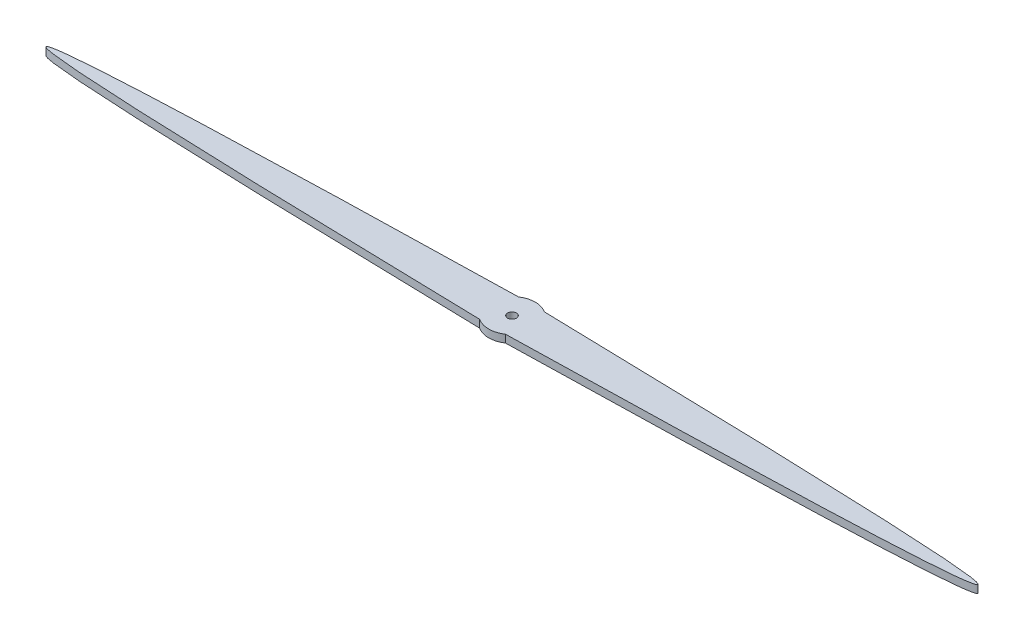
ISO-10303-21;
HEADER;
FILE_DESCRIPTION(('STEP AP214'),'2;1');
FILE_NAME('part.step','',(''),(''),'','','');
FILE_SCHEMA(('AUTOMOTIVE_DESIGN { 1 0 10303 214 1 1 1 1 }'));
ENDSEC;
DATA;
#1=APPLICATION_CONTEXT('core data for automotive mechanical design processes');
#2=APPLICATION_PROTOCOL_DEFINITION('international standard','automotive_design',2000,#1);
#3=PRODUCT_CONTEXT('',#1,'mechanical');
#4=PRODUCT('Part','Part','',(#3));
#5=PRODUCT_RELATED_PRODUCT_CATEGORY('part','',(#4));
#6=PRODUCT_DEFINITION_FORMATION('','',#4);
#7=PRODUCT_DEFINITION_CONTEXT('part definition',#1,'design');
#8=PRODUCT_DEFINITION('design','',#6,#7);
#9=PRODUCT_DEFINITION_SHAPE('','',#8);
#10=(LENGTH_UNIT() NAMED_UNIT(*) SI_UNIT(.MILLI.,.METRE.));
#11=(NAMED_UNIT(*) PLANE_ANGLE_UNIT() SI_UNIT($,.RADIAN.));
#12=(NAMED_UNIT(*) SI_UNIT($,.STERADIAN.) SOLID_ANGLE_UNIT());
#13=UNCERTAINTY_MEASURE_WITH_UNIT(LENGTH_MEASURE(1.E-05),#10,'distance_accuracy_value','');
#14=(GEOMETRIC_REPRESENTATION_CONTEXT(3) GLOBAL_UNCERTAINTY_ASSIGNED_CONTEXT((#13)) GLOBAL_UNIT_ASSIGNED_CONTEXT((#10,
#11,#12)) REPRESENTATION_CONTEXT('',''));
#15=CARTESIAN_POINT('',(0.,0.,0.));
#16=DIRECTION('',(0.,0.,1.));
#17=DIRECTION('',(1.,0.,0.));
#18=AXIS2_PLACEMENT_3D('',#15,#16,#17);
#19=CARTESIAN_POINT('',(152.4,2.5146,0.));
#20=DIRECTION('',(0.,1.,0.));
#21=DIRECTION('',(0.,0.,-1.));
#22=AXIS2_PLACEMENT_3D('',#19,#20,#21);
#23=PLANE('',#22);
#24=CARTESIAN_POINT('',(4.21211348375136,2.5146,-6.35));
#25=CARTESIAN_POINT('',(300.587886516249,2.5146,0.));
#26=CARTESIAN_POINT('',(4.21211348375136,2.5146,6.35));
#27=B_SPLINE_CURVE_WITH_KNOTS('',2,(#24,#25,#26),.UNSPECIFIED.,.F.,.F.,(3,3),(0.,1.),.UNSPECIFIED.);
#28=CARTESIAN_POINT('',(4.21211348375136,2.5146,-6.35));
#29=VERTEX_POINT('',#28);
#30=CARTESIAN_POINT('',(4.21211348375136,2.5146,6.35));
#31=VERTEX_POINT('',#30);
#32=EDGE_CURVE('E96',#29,#31,#27,.T.);
#33=ORIENTED_EDGE('',*,*,#32,.F.);
#34=CARTESIAN_POINT('',(0.,2.5146,0.));
#35=DIRECTION('',(0.,-1.,0.));
#36=DIRECTION('',(0.,0.,-1.));
#37=AXIS2_PLACEMENT_3D('',#34,#35,#36);
#38=CIRCLE('',#37,7.62);
#39=CARTESIAN_POINT('',(-4.21211348375136,2.5146,-6.35));
#40=VERTEX_POINT('',#39);
#41=EDGE_CURVE('E99',#40,#29,#38,.T.);
#42=ORIENTED_EDGE('',*,*,#41,.F.);
#43=CARTESIAN_POINT('',(-4.21211348375136,2.5146,6.35));
#44=CARTESIAN_POINT('',(-300.587886516249,2.5146,0.));
#45=CARTESIAN_POINT('',(-4.21211348375136,2.5146,-6.35));
#46=B_SPLINE_CURVE_WITH_KNOTS('',2,(#43,#44,#45),.UNSPECIFIED.,.F.,.F.,(3,3),(0.,1.),.UNSPECIFIED.);
#47=CARTESIAN_POINT('',(-4.21211348375135,2.5146,6.35));
#48=VERTEX_POINT('',#47);
#49=EDGE_CURVE('E87',#48,#40,#46,.T.);
#50=ORIENTED_EDGE('',*,*,#49,.F.);
#51=CARTESIAN_POINT('',(0.,2.5146,0.));
#52=DIRECTION('',(0.,-1.,0.));
#53=DIRECTION('',(0.,0.,-1.));
#54=AXIS2_PLACEMENT_3D('',#51,#52,#53);
#55=CIRCLE('',#54,7.62);
#56=EDGE_CURVE('E92',#31,#48,#55,.T.);
#57=ORIENTED_EDGE('',*,*,#56,.F.);
#58=EDGE_LOOP('',(#33,#42,#50,#57));
#59=FACE_BOUND('',#58,.T.);
#60=CARTESIAN_POINT('',(0.,2.5146,0.));
#61=DIRECTION('',(0.,-1.,0.));
#62=DIRECTION('',(0.,0.,-1.));
#63=AXIS2_PLACEMENT_3D('',#60,#61,#62);
#64=CIRCLE('',#63,1.46304);
#65=CARTESIAN_POINT('',(0.,2.5146,-1.46304));
#66=VERTEX_POINT('',#65);
#67=EDGE_CURVE('E135',#66,#66,#64,.T.);
#68=ORIENTED_EDGE('',*,*,#67,.T.);
#69=EDGE_LOOP('',(#68));
#70=FACE_BOUND('',#69,.T.);
#71=ADVANCED_FACE('F39',(#59,#70),#23,.T.);
#72=CARTESIAN_POINT('',(152.4,0.,0.));
#73=DIRECTION('',(0.,1.,0.));
#74=DIRECTION('',(0.,0.,-1.));
#75=AXIS2_PLACEMENT_3D('',#72,#73,#74);
#76=PLANE('',#75);
#77=CARTESIAN_POINT('',(4.21211348375136,0.,-6.35));
#78=CARTESIAN_POINT('',(300.587886516249,0.,0.));
#79=CARTESIAN_POINT('',(4.21211348375136,0.,6.35));
#80=B_SPLINE_CURVE_WITH_KNOTS('',2,(#77,#78,#79),.UNSPECIFIED.,.F.,.F.,(3,3),(0.,1.),.UNSPECIFIED.);
#81=CARTESIAN_POINT('',(4.21211348375136,0.,-6.35));
#82=VERTEX_POINT('',#81);
#83=CARTESIAN_POINT('',(4.21211348375136,0.,6.35));
#84=VERTEX_POINT('',#83);
#85=EDGE_CURVE('E141',#82,#84,#80,.T.);
#86=ORIENTED_EDGE('',*,*,#85,.T.);
#87=CARTESIAN_POINT('',(0.,0.,0.));
#88=DIRECTION('',(0.,-1.,0.));
#89=DIRECTION('',(0.,0.,-1.));
#90=AXIS2_PLACEMENT_3D('',#87,#88,#89);
#91=CIRCLE('',#90,7.62);
#92=CARTESIAN_POINT('',(-4.21211348375135,0.,6.35));
#93=VERTEX_POINT('',#92);
#94=EDGE_CURVE('E152',#84,#93,#91,.T.);
#95=ORIENTED_EDGE('',*,*,#94,.T.);
#96=CARTESIAN_POINT('',(-4.21211348375136,0.,6.35));
#97=CARTESIAN_POINT('',(-300.587886516249,0.,0.));
#98=CARTESIAN_POINT('',(-4.21211348375136,0.,-6.35));
#99=B_SPLINE_CURVE_WITH_KNOTS('',2,(#96,#97,#98),.UNSPECIFIED.,.F.,.F.,(3,3),(0.,1.),.UNSPECIFIED.);
#100=CARTESIAN_POINT('',(-4.21211348375136,0.,-6.35));
#101=VERTEX_POINT('',#100);
#102=EDGE_CURVE('E90',#93,#101,#99,.T.);
#103=ORIENTED_EDGE('',*,*,#102,.T.);
#104=CARTESIAN_POINT('',(0.,0.,0.));
#105=DIRECTION('',(0.,-1.,0.));
#106=DIRECTION('',(0.,0.,-1.));
#107=AXIS2_PLACEMENT_3D('',#104,#105,#106);
#108=CIRCLE('',#107,7.62);
#109=EDGE_CURVE('E146',#101,#82,#108,.T.);
#110=ORIENTED_EDGE('',*,*,#109,.T.);
#111=EDGE_LOOP('',(#86,#95,#103,#110));
#112=FACE_BOUND('',#111,.T.);
#113=CARTESIAN_POINT('',(0.,0.,0.));
#114=DIRECTION('',(0.,-1.,0.));
#115=DIRECTION('',(0.,0.,-1.));
#116=AXIS2_PLACEMENT_3D('',#113,#114,#115);
#117=CIRCLE('',#116,1.46304);
#118=CARTESIAN_POINT('',(0.,0.,-1.46304));
#119=VERTEX_POINT('',#118);
#120=EDGE_CURVE('E138',#119,#119,#117,.T.);
#121=ORIENTED_EDGE('',*,*,#120,.F.);
#122=EDGE_LOOP('',(#121));
#123=FACE_BOUND('',#122,.T.);
#124=ADVANCED_FACE('F118',(#112,#123),#76,.F.);
#125=DIRECTION('',(0.,-1.,0.));
#126=VECTOR('',#125,1.);
#127=SURFACE_OF_LINEAR_EXTRUSION('',#27,#126);
#128=ORIENTED_EDGE('',*,*,#85,.F.);
#129=DIRECTION('',(0.,-1.,0.));
#130=VECTOR('',#129,1.);
#131=CARTESIAN_POINT('',(4.21211348375136,2.5146,-6.35));
#132=LINE('',#131,#130);
#133=EDGE_CURVE('E57',#29,#82,#132,.T.);
#134=ORIENTED_EDGE('',*,*,#133,.F.);
#135=ORIENTED_EDGE('',*,*,#32,.T.);
#136=DIRECTION('',(0.,-1.,0.));
#137=VECTOR('',#136,1.);
#138=CARTESIAN_POINT('',(4.21211348375136,2.5146,6.35));
#139=LINE('',#138,#137);
#140=EDGE_CURVE('E11',#31,#84,#139,.T.);
#141=ORIENTED_EDGE('',*,*,#140,.T.);
#142=EDGE_LOOP('',(#128,#134,#135,#141));
#143=FACE_BOUND('',#142,.T.);
#144=ADVANCED_FACE('F41',(#143),#127,.T.);
#145=CARTESIAN_POINT('',(0.,2.5146,0.));
#146=DIRECTION('',(0.,-1.,0.));
#147=DIRECTION('',(0.,0.,1.));
#148=AXIS2_PLACEMENT_3D('',#145,#146,#147);
#149=CYLINDRICAL_SURFACE('',#148,7.62);
#150=ORIENTED_EDGE('',*,*,#94,.F.);
#151=ORIENTED_EDGE('',*,*,#140,.F.);
#152=ORIENTED_EDGE('',*,*,#56,.T.);
#153=DIRECTION('',(0.,-1.,0.));
#154=VECTOR('',#153,1.);
#155=CARTESIAN_POINT('',(-4.21211348375135,2.5146,6.35));
#156=LINE('',#155,#154);
#157=EDGE_CURVE('E49',#48,#93,#156,.T.);
#158=ORIENTED_EDGE('',*,*,#157,.T.);
#159=EDGE_LOOP('',(#150,#151,#152,#158));
#160=FACE_BOUND('',#159,.T.);
#161=ADVANCED_FACE('F93',(#160),#149,.T.);
#162=DIRECTION('',(0.,-1.,0.));
#163=VECTOR('',#162,1.);
#164=SURFACE_OF_LINEAR_EXTRUSION('',#46,#163);
#165=ORIENTED_EDGE('',*,*,#102,.F.);
#166=ORIENTED_EDGE('',*,*,#157,.F.);
#167=ORIENTED_EDGE('',*,*,#49,.T.);
#168=DIRECTION('',(0.,-1.,0.));
#169=VECTOR('',#168,1.);
#170=CARTESIAN_POINT('',(-4.21211348375136,2.5146,-6.35));
#171=LINE('',#170,#169);
#172=EDGE_CURVE('E73',#40,#101,#171,.T.);
#173=ORIENTED_EDGE('',*,*,#172,.T.);
#174=EDGE_LOOP('',(#165,#166,#167,#173));
#175=FACE_BOUND('',#174,.T.);
#176=ADVANCED_FACE('F85',(#175),#164,.T.);
#177=CARTESIAN_POINT('',(0.,2.5146,0.));
#178=DIRECTION('',(0.,-1.,0.));
#179=DIRECTION('',(0.,0.,1.));
#180=AXIS2_PLACEMENT_3D('',#177,#178,#179);
#181=CYLINDRICAL_SURFACE('',#180,7.62);
#182=ORIENTED_EDGE('',*,*,#109,.F.);
#183=ORIENTED_EDGE('',*,*,#172,.F.);
#184=ORIENTED_EDGE('',*,*,#41,.T.);
#185=ORIENTED_EDGE('',*,*,#133,.T.);
#186=EDGE_LOOP('',(#182,#183,#184,#185));
#187=FACE_BOUND('',#186,.T.);
#188=ADVANCED_FACE('F112',(#187),#181,.T.);
#189=CARTESIAN_POINT('',(0.,2.5146,0.));
#190=DIRECTION('',(0.,-1.,0.));
#191=DIRECTION('',(0.,0.,1.));
#192=AXIS2_PLACEMENT_3D('',#189,#190,#191);
#193=CYLINDRICAL_SURFACE('',#192,1.46304);
#194=ORIENTED_EDGE('',*,*,#67,.F.);
#195=EDGE_LOOP('',(#194));
#196=FACE_BOUND('',#195,.T.);
#197=ORIENTED_EDGE('',*,*,#120,.T.);
#198=EDGE_LOOP('',(#197));
#199=FACE_BOUND('',#198,.T.);
#200=ADVANCED_FACE('F126',(#196,#199),#193,.F.);
#201=CLOSED_SHELL('',(#71,#124,#144,#161,#176,#188,#200));
#202=MANIFOLD_SOLID_BREP('B2',#201);
#203=ADVANCED_BREP_SHAPE_REPRESENTATION('',(#18,#202),#14);
#204=SHAPE_DEFINITION_REPRESENTATION(#9,#203);
ENDSEC;
END-ISO-10303-21;
